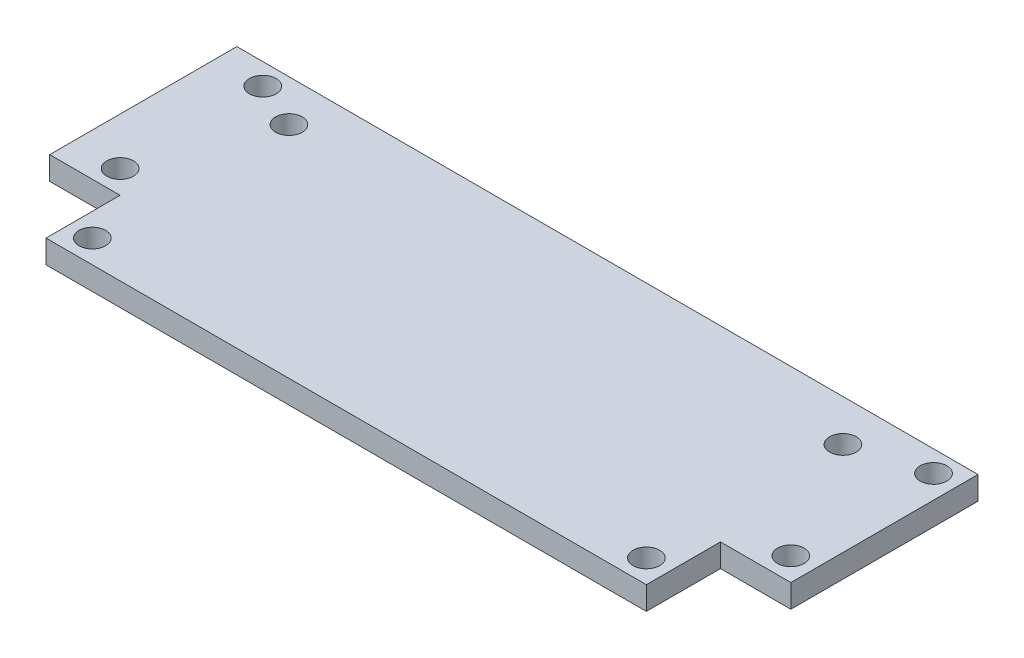
ISO-10303-21;
HEADER;
FILE_DESCRIPTION(('STEP AP214'),'2;1');
FILE_NAME('part.step','',(''),(''),'','','');
FILE_SCHEMA(('AUTOMOTIVE_DESIGN { 1 0 10303 214 1 1 1 1 }'));
ENDSEC;
DATA;
#1=APPLICATION_CONTEXT('core data for automotive mechanical design processes');
#2=APPLICATION_PROTOCOL_DEFINITION('international standard','automotive_design',2000,#1);
#3=PRODUCT_CONTEXT('',#1,'mechanical');
#4=PRODUCT('Part','Part','',(#3));
#5=PRODUCT_RELATED_PRODUCT_CATEGORY('part','',(#4));
#6=PRODUCT_DEFINITION_FORMATION('','',#4);
#7=PRODUCT_DEFINITION_CONTEXT('part definition',#1,'design');
#8=PRODUCT_DEFINITION('design','',#6,#7);
#9=PRODUCT_DEFINITION_SHAPE('','',#8);
#10=(LENGTH_UNIT() NAMED_UNIT(*) SI_UNIT(.MILLI.,.METRE.));
#11=(NAMED_UNIT(*) PLANE_ANGLE_UNIT() SI_UNIT($,.RADIAN.));
#12=(NAMED_UNIT(*) SI_UNIT($,.STERADIAN.) SOLID_ANGLE_UNIT());
#13=UNCERTAINTY_MEASURE_WITH_UNIT(LENGTH_MEASURE(1.E-05),#10,'distance_accuracy_value','');
#14=(GEOMETRIC_REPRESENTATION_CONTEXT(3) GLOBAL_UNCERTAINTY_ASSIGNED_CONTEXT((#13)) GLOBAL_UNIT_ASSIGNED_CONTEXT((#10,
#11,#12)) REPRESENTATION_CONTEXT('',''));
#15=CARTESIAN_POINT('',(0.,0.,0.));
#16=DIRECTION('',(0.,0.,1.));
#17=DIRECTION('',(1.,0.,0.));
#18=AXIS2_PLACEMENT_3D('',#15,#16,#17);
#19=CARTESIAN_POINT('',(-50.8,3.175,17.907));
#20=DIRECTION('',(1.,0.,0.));
#21=DIRECTION('',(0.,0.,-1.));
#22=AXIS2_PLACEMENT_3D('',#19,#20,#21);
#23=PLANE('',#22);
#24=DIRECTION('',(0.,0.,1.));
#25=VECTOR('',#24,1.);
#26=CARTESIAN_POINT('',(-50.8,0.,17.907));
#27=LINE('',#26,#25);
#28=CARTESIAN_POINT('',(-50.8,0.,-17.907));
#29=VERTEX_POINT('',#28);
#30=CARTESIAN_POINT('',(-50.8,0.,7.747));
#31=VERTEX_POINT('',#30);
#32=EDGE_CURVE('E118',#29,#31,#27,.T.);
#33=ORIENTED_EDGE('',*,*,#32,.T.);
#34=DIRECTION('',(0.,1.,0.));
#35=VECTOR('',#34,1.);
#36=CARTESIAN_POINT('',(-50.8,0.,7.747));
#37=LINE('',#36,#35);
#38=CARTESIAN_POINT('',(-50.8,3.175,7.747));
#39=VERTEX_POINT('',#38);
#40=EDGE_CURVE('E202',#31,#39,#37,.T.);
#41=ORIENTED_EDGE('',*,*,#40,.T.);
#42=DIRECTION('',(0.,0.,1.));
#43=VECTOR('',#42,1.);
#44=CARTESIAN_POINT('',(-50.8,3.175,17.907));
#45=LINE('',#44,#43);
#46=CARTESIAN_POINT('',(-50.8,3.175,-17.907));
#47=VERTEX_POINT('',#46);
#48=EDGE_CURVE('E127',#47,#39,#45,.T.);
#49=ORIENTED_EDGE('',*,*,#48,.F.);
#50=DIRECTION('',(0.,-1.,0.));
#51=VECTOR('',#50,1.);
#52=CARTESIAN_POINT('',(-50.8,3.175,-17.907));
#53=LINE('',#52,#51);
#54=EDGE_CURVE('E40',#47,#29,#53,.T.);
#55=ORIENTED_EDGE('',*,*,#54,.T.);
#56=EDGE_LOOP('',(#33,#41,#49,#55));
#57=FACE_BOUND('',#56,.T.);
#58=ADVANCED_FACE('F33',(#57),#23,.F.);
#59=CARTESIAN_POINT('',(50.8,3.175,17.907));
#60=DIRECTION('',(0.,0.,-1.));
#61=DIRECTION('',(-1.,0.,0.));
#62=AXIS2_PLACEMENT_3D('',#59,#60,#61);
#63=PLANE('',#62);
#64=DIRECTION('',(1.,0.,0.));
#65=VECTOR('',#64,1.);
#66=CARTESIAN_POINT('',(50.8,3.175,17.907));
#67=LINE('',#66,#65);
#68=CARTESIAN_POINT('',(-41.1483818136558,3.175,17.907));
#69=VERTEX_POINT('',#68);
#70=CARTESIAN_POINT('',(41.1483818136558,3.175,17.907));
#71=VERTEX_POINT('',#70);
#72=EDGE_CURVE('E113',#69,#71,#67,.T.);
#73=ORIENTED_EDGE('',*,*,#72,.F.);
#74=DIRECTION('',(0.,1.,0.));
#75=VECTOR('',#74,1.);
#76=CARTESIAN_POINT('',(-41.1483818136558,0.,17.907));
#77=LINE('',#76,#75);
#78=CARTESIAN_POINT('',(-41.1483818136558,0.,17.907));
#79=VERTEX_POINT('',#78);
#80=EDGE_CURVE('E101',#79,#69,#77,.T.);
#81=ORIENTED_EDGE('',*,*,#80,.F.);
#82=DIRECTION('',(1.,0.,0.));
#83=VECTOR('',#82,1.);
#84=CARTESIAN_POINT('',(50.8,0.,17.907));
#85=LINE('',#84,#83);
#86=CARTESIAN_POINT('',(41.1483818136558,0.,17.907));
#87=VERTEX_POINT('',#86);
#88=EDGE_CURVE('E112',#79,#87,#85,.T.);
#89=ORIENTED_EDGE('',*,*,#88,.T.);
#90=DIRECTION('',(0.,1.,0.));
#91=VECTOR('',#90,1.);
#92=CARTESIAN_POINT('',(41.1483818136558,0.,17.907));
#93=LINE('',#92,#91);
#94=EDGE_CURVE('E187',#87,#71,#93,.T.);
#95=ORIENTED_EDGE('',*,*,#94,.T.);
#96=EDGE_LOOP('',(#73,#81,#89,#95));
#97=FACE_BOUND('',#96,.T.);
#98=ADVANCED_FACE('F110',(#97),#63,.F.);
#99=CARTESIAN_POINT('',(50.8,3.175,17.907));
#100=DIRECTION('',(-1.,0.,0.));
#101=DIRECTION('',(0.,0.,1.));
#102=AXIS2_PLACEMENT_3D('',#99,#100,#101);
#103=PLANE('',#102);
#104=DIRECTION('',(0.,0.,-1.));
#105=VECTOR('',#104,1.);
#106=CARTESIAN_POINT('',(50.8,3.175,17.907));
#107=LINE('',#106,#105);
#108=CARTESIAN_POINT('',(50.8,3.175,7.747));
#109=VERTEX_POINT('',#108);
#110=CARTESIAN_POINT('',(50.8,3.175,-17.907));
#111=VERTEX_POINT('',#110);
#112=EDGE_CURVE('E134',#109,#111,#107,.T.);
#113=ORIENTED_EDGE('',*,*,#112,.F.);
#114=DIRECTION('',(0.,1.,0.));
#115=VECTOR('',#114,1.);
#116=CARTESIAN_POINT('',(50.8,0.,7.747));
#117=LINE('',#116,#115);
#118=CARTESIAN_POINT('',(50.8,0.,7.747));
#119=VERTEX_POINT('',#118);
#120=EDGE_CURVE('E190',#119,#109,#117,.T.);
#121=ORIENTED_EDGE('',*,*,#120,.F.);
#122=DIRECTION('',(0.,0.,-1.));
#123=VECTOR('',#122,1.);
#124=CARTESIAN_POINT('',(50.8,0.,17.907));
#125=LINE('',#124,#123);
#126=CARTESIAN_POINT('',(50.8,0.,-17.907));
#127=VERTEX_POINT('',#126);
#128=EDGE_CURVE('E117',#119,#127,#125,.T.);
#129=ORIENTED_EDGE('',*,*,#128,.T.);
#130=DIRECTION('',(0.,-1.,0.));
#131=VECTOR('',#130,1.);
#132=CARTESIAN_POINT('',(50.8,3.175,-17.907));
#133=LINE('',#132,#131);
#134=EDGE_CURVE('E11',#111,#127,#133,.T.);
#135=ORIENTED_EDGE('',*,*,#134,.F.);
#136=EDGE_LOOP('',(#113,#121,#129,#135));
#137=FACE_BOUND('',#136,.T.);
#138=ADVANCED_FACE('F232',(#137),#103,.F.);
#139=CARTESIAN_POINT('',(50.8,3.175,-17.907));
#140=DIRECTION('',(0.,0.,1.));
#141=DIRECTION('',(1.,0.,0.));
#142=AXIS2_PLACEMENT_3D('',#139,#140,#141);
#143=PLANE('',#142);
#144=DIRECTION('',(-1.,0.,0.));
#145=VECTOR('',#144,1.);
#146=CARTESIAN_POINT('',(50.8,0.,-17.907));
#147=LINE('',#146,#145);
#148=EDGE_CURVE('E120',#127,#29,#147,.T.);
#149=ORIENTED_EDGE('',*,*,#148,.T.);
#150=ORIENTED_EDGE('',*,*,#54,.F.);
#151=DIRECTION('',(-1.,0.,0.));
#152=VECTOR('',#151,1.);
#153=CARTESIAN_POINT('',(50.8,3.175,-17.907));
#154=LINE('',#153,#152);
#155=EDGE_CURVE('E129',#111,#47,#154,.T.);
#156=ORIENTED_EDGE('',*,*,#155,.F.);
#157=ORIENTED_EDGE('',*,*,#134,.T.);
#158=EDGE_LOOP('',(#149,#150,#156,#157));
#159=FACE_BOUND('',#158,.T.);
#160=ADVANCED_FACE('F236',(#159),#143,.F.);
#161=CARTESIAN_POINT('',(0.,3.175,0.));
#162=DIRECTION('',(0.,1.,0.));
#163=DIRECTION('',(0.,0.,1.));
#164=AXIS2_PLACEMENT_3D('',#161,#162,#163);
#165=PLANE('',#164);
#166=DIRECTION('',(-1.,0.,0.));
#167=VECTOR('',#166,1.);
#168=CARTESIAN_POINT('',(-50.8,3.175,7.747));
#169=LINE('',#168,#167);
#170=CARTESIAN_POINT('',(-41.1483818136558,3.175,7.747));
#171=VERTEX_POINT('',#170);
#172=EDGE_CURVE('E106',#171,#39,#169,.T.);
#173=ORIENTED_EDGE('',*,*,#172,.F.);
#174=DIRECTION('',(0.,0.,-1.));
#175=VECTOR('',#174,1.);
#176=CARTESIAN_POINT('',(-41.1483818136558,3.175,17.907));
#177=LINE('',#176,#175);
#178=EDGE_CURVE('E209',#69,#171,#177,.T.);
#179=ORIENTED_EDGE('',*,*,#178,.F.);
#180=ORIENTED_EDGE('',*,*,#72,.T.);
#181=DIRECTION('',(0.,0.,1.));
#182=VECTOR('',#181,1.);
#183=CARTESIAN_POINT('',(41.1483818136558,3.175,17.907));
#184=LINE('',#183,#182);
#185=CARTESIAN_POINT('',(41.1483818136558,3.175,7.747));
#186=VERTEX_POINT('',#185);
#187=EDGE_CURVE('E195',#186,#71,#184,.T.);
#188=ORIENTED_EDGE('',*,*,#187,.F.);
#189=DIRECTION('',(-1.,0.,0.));
#190=VECTOR('',#189,1.);
#191=CARTESIAN_POINT('',(50.8,3.175,7.747));
#192=LINE('',#191,#190);
#193=EDGE_CURVE('E199',#109,#186,#192,.T.);
#194=ORIENTED_EDGE('',*,*,#193,.F.);
#195=ORIENTED_EDGE('',*,*,#112,.T.);
#196=ORIENTED_EDGE('',*,*,#155,.T.);
#197=ORIENTED_EDGE('',*,*,#48,.T.);
#198=EDGE_LOOP('',(#173,#179,#180,#188,#194,#195,#196,#197));
#199=FACE_BOUND('',#198,.T.);
#200=CARTESIAN_POINT('',(37.973,3.175,-12.2174));
#201=DIRECTION('',(0.,1.,0.));
#202=DIRECTION('',(0.,0.,-1.));
#203=AXIS2_PLACEMENT_3D('',#200,#201,#202);
#204=CIRCLE('',#203,1.8288);
#205=CARTESIAN_POINT('',(37.973,3.175,-14.0462));
#206=VERTEX_POINT('',#205);
#207=EDGE_CURVE('E184',#206,#206,#204,.T.);
#208=ORIENTED_EDGE('',*,*,#207,.F.);
#209=EDGE_LOOP('',(#208));
#210=FACE_BOUND('',#209,.T.);
#211=CARTESIAN_POINT('',(37.973,3.175,14.732));
#212=DIRECTION('',(0.,1.,0.));
#213=DIRECTION('',(0.,0.,-1.));
#214=AXIS2_PLACEMENT_3D('',#211,#212,#213);
#215=CIRCLE('',#214,1.8288);
#216=CARTESIAN_POINT('',(37.973,3.175,12.9032));
#217=VERTEX_POINT('',#216);
#218=EDGE_CURVE('E178',#217,#217,#215,.T.);
#219=ORIENTED_EDGE('',*,*,#218,.F.);
#220=EDGE_LOOP('',(#219));
#221=FACE_BOUND('',#220,.T.);
#222=CARTESIAN_POINT('',(-37.973,3.175,-12.2174));
#223=DIRECTION('',(0.,1.,0.));
#224=DIRECTION('',(0.,0.,1.));
#225=AXIS2_PLACEMENT_3D('',#222,#223,#224);
#226=CIRCLE('',#225,1.8288);
#227=CARTESIAN_POINT('',(-37.973,3.175,-10.3886));
#228=VERTEX_POINT('',#227);
#229=EDGE_CURVE('E172',#228,#228,#226,.T.);
#230=ORIENTED_EDGE('',*,*,#229,.F.);
#231=EDGE_LOOP('',(#230));
#232=FACE_BOUND('',#231,.T.);
#233=CARTESIAN_POINT('',(-37.973,3.175,14.732));
#234=DIRECTION('',(0.,1.,0.));
#235=DIRECTION('',(0.,0.,1.));
#236=AXIS2_PLACEMENT_3D('',#233,#234,#235);
#237=CIRCLE('',#236,1.8288);
#238=CARTESIAN_POINT('',(-37.973,3.175,16.5608));
#239=VERTEX_POINT('',#238);
#240=EDGE_CURVE('E166',#239,#239,#237,.T.);
#241=ORIENTED_EDGE('',*,*,#240,.F.);
#242=EDGE_LOOP('',(#241));
#243=FACE_BOUND('',#242,.T.);
#244=CARTESIAN_POINT('',(-44.323,3.175,4.572));
#245=DIRECTION('',(0.,1.,0.));
#246=DIRECTION('',(0.,0.,1.));
#247=AXIS2_PLACEMENT_3D('',#244,#245,#246);
#248=CIRCLE('',#247,1.8288);
#249=CARTESIAN_POINT('',(-44.323,3.175,6.40079999999999));
#250=VERTEX_POINT('',#249);
#251=EDGE_CURVE('E160',#250,#250,#248,.T.);
#252=ORIENTED_EDGE('',*,*,#251,.F.);
#253=EDGE_LOOP('',(#252));
#254=FACE_BOUND('',#253,.T.);
#255=CARTESIAN_POINT('',(-44.323,3.175,-14.986));
#256=DIRECTION('',(0.,1.,0.));
#257=DIRECTION('',(0.,0.,1.));
#258=AXIS2_PLACEMENT_3D('',#255,#256,#257);
#259=CIRCLE('',#258,1.8288);
#260=CARTESIAN_POINT('',(-44.323,3.175,-13.1572));
#261=VERTEX_POINT('',#260);
#262=EDGE_CURVE('E154',#261,#261,#259,.T.);
#263=ORIENTED_EDGE('',*,*,#262,.F.);
#264=EDGE_LOOP('',(#263));
#265=FACE_BOUND('',#264,.T.);
#266=CARTESIAN_POINT('',(47.625,3.175,4.572));
#267=DIRECTION('',(0.,1.,0.));
#268=DIRECTION('',(0.,0.,1.));
#269=AXIS2_PLACEMENT_3D('',#266,#267,#268);
#270=CIRCLE('',#269,1.8288);
#271=CARTESIAN_POINT('',(47.625,3.175,6.40079999999999));
#272=VERTEX_POINT('',#271);
#273=EDGE_CURVE('E148',#272,#272,#270,.T.);
#274=ORIENTED_EDGE('',*,*,#273,.F.);
#275=EDGE_LOOP('',(#274));
#276=FACE_BOUND('',#275,.T.);
#277=CARTESIAN_POINT('',(47.625,3.175,-14.986));
#278=DIRECTION('',(0.,1.,0.));
#279=DIRECTION('',(0.,0.,1.));
#280=AXIS2_PLACEMENT_3D('',#277,#278,#279);
#281=CIRCLE('',#280,1.82880000000001);
#282=CARTESIAN_POINT('',(47.625,3.175,-13.1572));
#283=VERTEX_POINT('',#282);
#284=EDGE_CURVE('E142',#283,#283,#281,.T.);
#285=ORIENTED_EDGE('',*,*,#284,.F.);
#286=EDGE_LOOP('',(#285));
#287=FACE_BOUND('',#286,.T.);
#288=ADVANCED_FACE('F213',(#199,#210,#221,#232,#243,#254,#265,#276,#287),#165,.T.);
#289=CARTESIAN_POINT('',(0.,0.,0.));
#290=DIRECTION('',(0.,1.,0.));
#291=DIRECTION('',(0.,0.,1.));
#292=AXIS2_PLACEMENT_3D('',#289,#290,#291);
#293=PLANE('',#292);
#294=CARTESIAN_POINT('',(37.973,0.,-12.2174));
#295=DIRECTION('',(0.,1.,0.));
#296=DIRECTION('',(0.,0.,-1.));
#297=AXIS2_PLACEMENT_3D('',#294,#295,#296);
#298=CIRCLE('',#297,1.8288);
#299=CARTESIAN_POINT('',(37.973,0.,-14.0462));
#300=VERTEX_POINT('',#299);
#301=EDGE_CURVE('E181',#300,#300,#298,.T.);
#302=ORIENTED_EDGE('',*,*,#301,.T.);
#303=EDGE_LOOP('',(#302));
#304=FACE_BOUND('',#303,.T.);
#305=CARTESIAN_POINT('',(37.973,0.,14.732));
#306=DIRECTION('',(0.,1.,0.));
#307=DIRECTION('',(0.,0.,-1.));
#308=AXIS2_PLACEMENT_3D('',#305,#306,#307);
#309=CIRCLE('',#308,1.8288);
#310=CARTESIAN_POINT('',(37.973,0.,12.9032));
#311=VERTEX_POINT('',#310);
#312=EDGE_CURVE('E175',#311,#311,#309,.T.);
#313=ORIENTED_EDGE('',*,*,#312,.T.);
#314=EDGE_LOOP('',(#313));
#315=FACE_BOUND('',#314,.T.);
#316=CARTESIAN_POINT('',(-37.973,0.,-12.2174));
#317=DIRECTION('',(0.,1.,0.));
#318=DIRECTION('',(0.,0.,1.));
#319=AXIS2_PLACEMENT_3D('',#316,#317,#318);
#320=CIRCLE('',#319,1.8288);
#321=CARTESIAN_POINT('',(-37.973,0.,-10.3886));
#322=VERTEX_POINT('',#321);
#323=EDGE_CURVE('E169',#322,#322,#320,.T.);
#324=ORIENTED_EDGE('',*,*,#323,.T.);
#325=EDGE_LOOP('',(#324));
#326=FACE_BOUND('',#325,.T.);
#327=CARTESIAN_POINT('',(-37.973,0.,14.732));
#328=DIRECTION('',(0.,1.,0.));
#329=DIRECTION('',(0.,0.,1.));
#330=AXIS2_PLACEMENT_3D('',#327,#328,#329);
#331=CIRCLE('',#330,1.8288);
#332=CARTESIAN_POINT('',(-37.973,0.,16.5608));
#333=VERTEX_POINT('',#332);
#334=EDGE_CURVE('E163',#333,#333,#331,.T.);
#335=ORIENTED_EDGE('',*,*,#334,.T.);
#336=EDGE_LOOP('',(#335));
#337=FACE_BOUND('',#336,.T.);
#338=CARTESIAN_POINT('',(-44.323,0.,4.572));
#339=DIRECTION('',(0.,1.,0.));
#340=DIRECTION('',(0.,0.,1.));
#341=AXIS2_PLACEMENT_3D('',#338,#339,#340);
#342=CIRCLE('',#341,1.8288);
#343=CARTESIAN_POINT('',(-44.323,0.,6.40079999999999));
#344=VERTEX_POINT('',#343);
#345=EDGE_CURVE('E157',#344,#344,#342,.T.);
#346=ORIENTED_EDGE('',*,*,#345,.T.);
#347=EDGE_LOOP('',(#346));
#348=FACE_BOUND('',#347,.T.);
#349=CARTESIAN_POINT('',(-44.323,0.,-14.986));
#350=DIRECTION('',(0.,1.,0.));
#351=DIRECTION('',(0.,0.,1.));
#352=AXIS2_PLACEMENT_3D('',#349,#350,#351);
#353=CIRCLE('',#352,1.8288);
#354=CARTESIAN_POINT('',(-44.323,0.,-13.1572));
#355=VERTEX_POINT('',#354);
#356=EDGE_CURVE('E151',#355,#355,#353,.T.);
#357=ORIENTED_EDGE('',*,*,#356,.T.);
#358=EDGE_LOOP('',(#357));
#359=FACE_BOUND('',#358,.T.);
#360=CARTESIAN_POINT('',(47.625,0.,4.572));
#361=DIRECTION('',(0.,1.,0.));
#362=DIRECTION('',(0.,0.,1.));
#363=AXIS2_PLACEMENT_3D('',#360,#361,#362);
#364=CIRCLE('',#363,1.8288);
#365=CARTESIAN_POINT('',(47.625,0.,6.40079999999999));
#366=VERTEX_POINT('',#365);
#367=EDGE_CURVE('E145',#366,#366,#364,.T.);
#368=ORIENTED_EDGE('',*,*,#367,.T.);
#369=EDGE_LOOP('',(#368));
#370=FACE_BOUND('',#369,.T.);
#371=CARTESIAN_POINT('',(47.625,0.,-14.986));
#372=DIRECTION('',(0.,1.,0.));
#373=DIRECTION('',(0.,0.,1.));
#374=AXIS2_PLACEMENT_3D('',#371,#372,#373);
#375=CIRCLE('',#374,1.82880000000001);
#376=CARTESIAN_POINT('',(47.625,0.,-13.1572));
#377=VERTEX_POINT('',#376);
#378=EDGE_CURVE('E123',#377,#377,#375,.T.);
#379=ORIENTED_EDGE('',*,*,#378,.T.);
#380=EDGE_LOOP('',(#379));
#381=FACE_BOUND('',#380,.T.);
#382=DIRECTION('',(0.,0.,-1.));
#383=VECTOR('',#382,1.);
#384=CARTESIAN_POINT('',(-41.1483818136558,0.,17.907));
#385=LINE('',#384,#383);
#386=CARTESIAN_POINT('',(-41.1483818136558,0.,7.747));
#387=VERTEX_POINT('',#386);
#388=EDGE_CURVE('E97',#79,#387,#385,.T.);
#389=ORIENTED_EDGE('',*,*,#388,.T.);
#390=DIRECTION('',(-1.,0.,0.));
#391=VECTOR('',#390,1.);
#392=CARTESIAN_POINT('',(-50.8,0.,7.747));
#393=LINE('',#392,#391);
#394=EDGE_CURVE('E47',#387,#31,#393,.T.);
#395=ORIENTED_EDGE('',*,*,#394,.T.);
#396=ORIENTED_EDGE('',*,*,#32,.F.);
#397=ORIENTED_EDGE('',*,*,#148,.F.);
#398=ORIENTED_EDGE('',*,*,#128,.F.);
#399=DIRECTION('',(-1.,0.,0.));
#400=VECTOR('',#399,1.);
#401=CARTESIAN_POINT('',(50.8,0.,7.747));
#402=LINE('',#401,#400);
#403=CARTESIAN_POINT('',(41.1483818136558,0.,7.747));
#404=VERTEX_POINT('',#403);
#405=EDGE_CURVE('E198',#119,#404,#402,.T.);
#406=ORIENTED_EDGE('',*,*,#405,.T.);
#407=DIRECTION('',(0.,0.,1.));
#408=VECTOR('',#407,1.);
#409=CARTESIAN_POINT('',(41.1483818136558,0.,17.907));
#410=LINE('',#409,#408);
#411=EDGE_CURVE('E55',#404,#87,#410,.T.);
#412=ORIENTED_EDGE('',*,*,#411,.T.);
#413=ORIENTED_EDGE('',*,*,#88,.F.);
#414=EDGE_LOOP('',(#389,#395,#396,#397,#398,#406,#412,#413));
#415=FACE_BOUND('',#414,.T.);
#416=ADVANCED_FACE('F115',(#304,#315,#326,#337,#348,#359,#370,#381,#415),#293,.F.);
#417=CARTESIAN_POINT('',(47.625,0.,-14.986));
#418=DIRECTION('',(0.,1.,0.));
#419=DIRECTION('',(0.,0.,1.));
#420=AXIS2_PLACEMENT_3D('',#417,#418,#419);
#421=CYLINDRICAL_SURFACE('',#420,1.82880000000001);
#422=ORIENTED_EDGE('',*,*,#378,.F.);
#423=EDGE_LOOP('',(#422));
#424=FACE_BOUND('',#423,.T.);
#425=ORIENTED_EDGE('',*,*,#284,.T.);
#426=EDGE_LOOP('',(#425));
#427=FACE_BOUND('',#426,.T.);
#428=ADVANCED_FACE('F245',(#424,#427),#421,.F.);
#429=CARTESIAN_POINT('',(47.625,0.,4.572));
#430=DIRECTION('',(0.,1.,0.));
#431=DIRECTION('',(0.,0.,1.));
#432=AXIS2_PLACEMENT_3D('',#429,#430,#431);
#433=CYLINDRICAL_SURFACE('',#432,1.8288);
#434=ORIENTED_EDGE('',*,*,#367,.F.);
#435=EDGE_LOOP('',(#434));
#436=FACE_BOUND('',#435,.T.);
#437=ORIENTED_EDGE('',*,*,#273,.T.);
#438=EDGE_LOOP('',(#437));
#439=FACE_BOUND('',#438,.T.);
#440=ADVANCED_FACE('F251',(#436,#439),#433,.F.);
#441=CARTESIAN_POINT('',(-44.323,0.,-14.986));
#442=DIRECTION('',(0.,1.,0.));
#443=DIRECTION('',(0.,0.,1.));
#444=AXIS2_PLACEMENT_3D('',#441,#442,#443);
#445=CYLINDRICAL_SURFACE('',#444,1.8288);
#446=ORIENTED_EDGE('',*,*,#356,.F.);
#447=EDGE_LOOP('',(#446));
#448=FACE_BOUND('',#447,.T.);
#449=ORIENTED_EDGE('',*,*,#262,.T.);
#450=EDGE_LOOP('',(#449));
#451=FACE_BOUND('',#450,.T.);
#452=ADVANCED_FACE('F255',(#448,#451),#445,.F.);
#453=CARTESIAN_POINT('',(-44.323,0.,4.572));
#454=DIRECTION('',(0.,1.,0.));
#455=DIRECTION('',(0.,0.,1.));
#456=AXIS2_PLACEMENT_3D('',#453,#454,#455);
#457=CYLINDRICAL_SURFACE('',#456,1.8288);
#458=ORIENTED_EDGE('',*,*,#345,.F.);
#459=EDGE_LOOP('',(#458));
#460=FACE_BOUND('',#459,.T.);
#461=ORIENTED_EDGE('',*,*,#251,.T.);
#462=EDGE_LOOP('',(#461));
#463=FACE_BOUND('',#462,.T.);
#464=ADVANCED_FACE('F259',(#460,#463),#457,.F.);
#465=CARTESIAN_POINT('',(-37.973,0.,14.732));
#466=DIRECTION('',(0.,1.,0.));
#467=DIRECTION('',(0.,0.,1.));
#468=AXIS2_PLACEMENT_3D('',#465,#466,#467);
#469=CYLINDRICAL_SURFACE('',#468,1.8288);
#470=ORIENTED_EDGE('',*,*,#334,.F.);
#471=EDGE_LOOP('',(#470));
#472=FACE_BOUND('',#471,.T.);
#473=ORIENTED_EDGE('',*,*,#240,.T.);
#474=EDGE_LOOP('',(#473));
#475=FACE_BOUND('',#474,.T.);
#476=ADVANCED_FACE('F263',(#472,#475),#469,.F.);
#477=CARTESIAN_POINT('',(-37.973,0.,-12.2174));
#478=DIRECTION('',(0.,1.,0.));
#479=DIRECTION('',(0.,0.,1.));
#480=AXIS2_PLACEMENT_3D('',#477,#478,#479);
#481=CYLINDRICAL_SURFACE('',#480,1.8288);
#482=ORIENTED_EDGE('',*,*,#323,.F.);
#483=EDGE_LOOP('',(#482));
#484=FACE_BOUND('',#483,.T.);
#485=ORIENTED_EDGE('',*,*,#229,.T.);
#486=EDGE_LOOP('',(#485));
#487=FACE_BOUND('',#486,.T.);
#488=ADVANCED_FACE('F267',(#484,#487),#481,.F.);
#489=CARTESIAN_POINT('',(37.973,0.,14.732));
#490=DIRECTION('',(0.,1.,0.));
#491=DIRECTION('',(0.,0.,1.));
#492=AXIS2_PLACEMENT_3D('',#489,#490,#491);
#493=CYLINDRICAL_SURFACE('',#492,1.8288);
#494=ORIENTED_EDGE('',*,*,#312,.F.);
#495=EDGE_LOOP('',(#494));
#496=FACE_BOUND('',#495,.T.);
#497=ORIENTED_EDGE('',*,*,#218,.T.);
#498=EDGE_LOOP('',(#497));
#499=FACE_BOUND('',#498,.T.);
#500=ADVANCED_FACE('F271',(#496,#499),#493,.F.);
#501=CARTESIAN_POINT('',(37.973,0.,-12.2174));
#502=DIRECTION('',(0.,1.,0.));
#503=DIRECTION('',(0.,0.,1.));
#504=AXIS2_PLACEMENT_3D('',#501,#502,#503);
#505=CYLINDRICAL_SURFACE('',#504,1.8288);
#506=ORIENTED_EDGE('',*,*,#301,.F.);
#507=EDGE_LOOP('',(#506));
#508=FACE_BOUND('',#507,.T.);
#509=ORIENTED_EDGE('',*,*,#207,.T.);
#510=EDGE_LOOP('',(#509));
#511=FACE_BOUND('',#510,.T.);
#512=ADVANCED_FACE('F275',(#508,#511),#505,.F.);
#513=CARTESIAN_POINT('',(41.1483818136558,0.,17.907));
#514=DIRECTION('',(-1.,0.,0.));
#515=DIRECTION('',(0.,0.,1.));
#516=AXIS2_PLACEMENT_3D('',#513,#514,#515);
#517=PLANE('',#516);
#518=ORIENTED_EDGE('',*,*,#187,.T.);
#519=ORIENTED_EDGE('',*,*,#94,.F.);
#520=ORIENTED_EDGE('',*,*,#411,.F.);
#521=DIRECTION('',(0.,1.,0.));
#522=VECTOR('',#521,1.);
#523=CARTESIAN_POINT('',(41.1483818136558,0.,7.747));
#524=LINE('',#523,#522);
#525=EDGE_CURVE('E192',#404,#186,#524,.T.);
#526=ORIENTED_EDGE('',*,*,#525,.T.);
#527=EDGE_LOOP('',(#518,#519,#520,#526));
#528=FACE_BOUND('',#527,.T.);
#529=ADVANCED_FACE('F224',(#528),#517,.F.);
#530=CARTESIAN_POINT('',(50.8,0.,7.747));
#531=DIRECTION('',(0.,0.,-1.));
#532=DIRECTION('',(-1.,0.,0.));
#533=AXIS2_PLACEMENT_3D('',#530,#531,#532);
#534=PLANE('',#533);
#535=ORIENTED_EDGE('',*,*,#193,.T.);
#536=ORIENTED_EDGE('',*,*,#525,.F.);
#537=ORIENTED_EDGE('',*,*,#405,.F.);
#538=ORIENTED_EDGE('',*,*,#120,.T.);
#539=EDGE_LOOP('',(#535,#536,#537,#538));
#540=FACE_BOUND('',#539,.T.);
#541=ADVANCED_FACE('F217',(#540),#534,.F.);
#542=CARTESIAN_POINT('',(-50.8,0.,7.747));
#543=DIRECTION('',(0.,0.,-1.));
#544=DIRECTION('',(-1.,0.,0.));
#545=AXIS2_PLACEMENT_3D('',#542,#543,#544);
#546=PLANE('',#545);
#547=ORIENTED_EDGE('',*,*,#172,.T.);
#548=ORIENTED_EDGE('',*,*,#40,.F.);
#549=ORIENTED_EDGE('',*,*,#394,.F.);
#550=DIRECTION('',(0.,1.,0.));
#551=VECTOR('',#550,1.);
#552=CARTESIAN_POINT('',(-41.1483818136558,0.,7.747));
#553=LINE('',#552,#551);
#554=EDGE_CURVE('E103',#387,#171,#553,.T.);
#555=ORIENTED_EDGE('',*,*,#554,.T.);
#556=EDGE_LOOP('',(#547,#548,#549,#555));
#557=FACE_BOUND('',#556,.T.);
#558=ADVANCED_FACE('F215',(#557),#546,.F.);
#559=CARTESIAN_POINT('',(-41.1483818136558,0.,17.907));
#560=DIRECTION('',(1.,0.,0.));
#561=DIRECTION('',(0.,0.,-1.));
#562=AXIS2_PLACEMENT_3D('',#559,#560,#561);
#563=PLANE('',#562);
#564=ORIENTED_EDGE('',*,*,#178,.T.);
#565=ORIENTED_EDGE('',*,*,#554,.F.);
#566=ORIENTED_EDGE('',*,*,#388,.F.);
#567=ORIENTED_EDGE('',*,*,#80,.T.);
#568=EDGE_LOOP('',(#564,#565,#566,#567));
#569=FACE_BOUND('',#568,.T.);
#570=ADVANCED_FACE('F100',(#569),#563,.F.);
#571=CLOSED_SHELL('',(#58,#98,#138,#160,#288,#416,#428,#440,#452,#464,#476,#488,#500,#512,#529,
#541,#558,#570));
#572=MANIFOLD_SOLID_BREP('B2',#571);
#573=ADVANCED_BREP_SHAPE_REPRESENTATION('',(#18,#572),#14);
#574=SHAPE_DEFINITION_REPRESENTATION(#9,#573);
ENDSEC;
END-ISO-10303-21;
